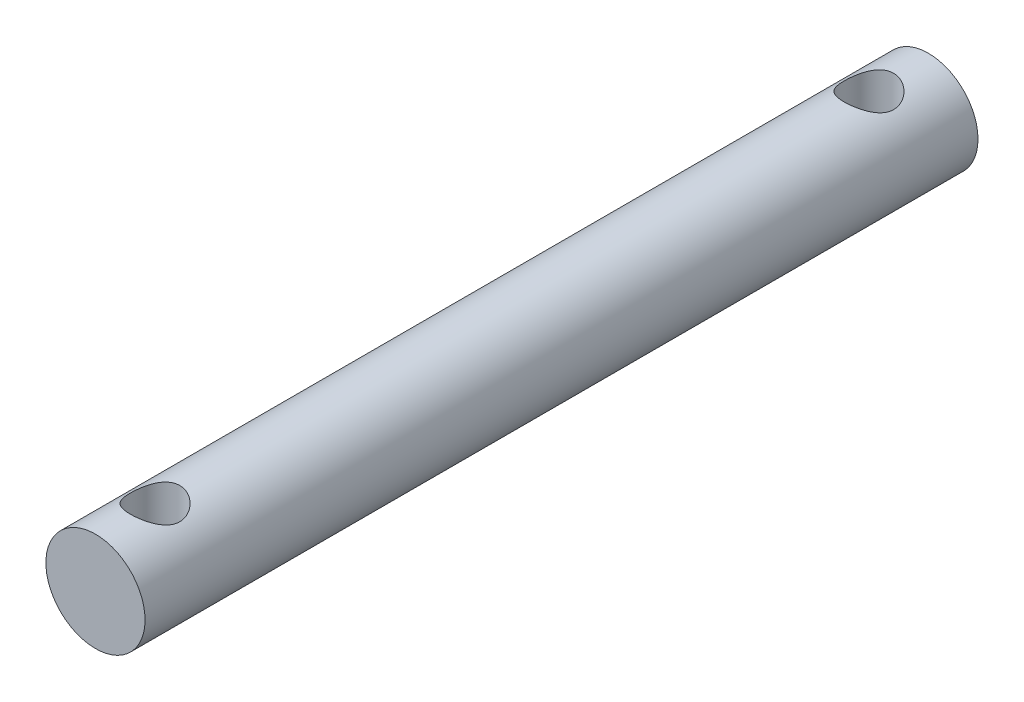
ISO-10303-21;
HEADER;
FILE_DESCRIPTION(('STEP AP214'),'2;1');
FILE_NAME('part.step','',(''),(''),'','','');
FILE_SCHEMA(('AUTOMOTIVE_DESIGN { 1 0 10303 214 1 1 1 1 }'));
ENDSEC;
DATA;
#1=APPLICATION_CONTEXT('core data for automotive mechanical design processes');
#2=APPLICATION_PROTOCOL_DEFINITION('international standard','automotive_design',2000,#1);
#3=PRODUCT_CONTEXT('',#1,'mechanical');
#4=PRODUCT('Part','Part','',(#3));
#5=PRODUCT_RELATED_PRODUCT_CATEGORY('part','',(#4));
#6=PRODUCT_DEFINITION_FORMATION('','',#4);
#7=PRODUCT_DEFINITION_CONTEXT('part definition',#1,'design');
#8=PRODUCT_DEFINITION('design','',#6,#7);
#9=PRODUCT_DEFINITION_SHAPE('','',#8);
#10=(LENGTH_UNIT() NAMED_UNIT(*) SI_UNIT(.MILLI.,.METRE.));
#11=(NAMED_UNIT(*) PLANE_ANGLE_UNIT() SI_UNIT($,.RADIAN.));
#12=(NAMED_UNIT(*) SI_UNIT($,.STERADIAN.) SOLID_ANGLE_UNIT());
#13=UNCERTAINTY_MEASURE_WITH_UNIT(LENGTH_MEASURE(1.E-05),#10,'distance_accuracy_value','');
#14=(GEOMETRIC_REPRESENTATION_CONTEXT(3) GLOBAL_UNCERTAINTY_ASSIGNED_CONTEXT((#13)) GLOBAL_UNIT_ASSIGNED_CONTEXT((#10,
#11,#12)) REPRESENTATION_CONTEXT('',''));
#15=CARTESIAN_POINT('',(0.,0.,0.));
#16=DIRECTION('',(0.,0.,1.));
#17=DIRECTION('',(1.,0.,0.));
#18=AXIS2_PLACEMENT_3D('',#15,#16,#17);
#19=CARTESIAN_POINT('',(0.,0.,42.));
#20=DIRECTION('',(0.,0.,-1.));
#21=DIRECTION('',(-1.,0.,0.));
#22=AXIS2_PLACEMENT_3D('',#19,#20,#21);
#23=CYLINDRICAL_SURFACE('',#22,2.5);
#24=CARTESIAN_POINT('',(0.,-2.5,4.25));
#25=CARTESIAN_POINT('',(0.065714953691233,-2.49999641755189,4.24999587210062));
#26=CARTESIAN_POINT('',(0.13150824962254,-2.49738113774397,4.24478740859791));
#27=CARTESIAN_POINT('',(0.261150294085531,-2.48717695046745,4.22418389957385));
#28=CARTESIAN_POINT('',(0.324995108391879,-2.47957859786229,4.20876950875294));
#29=CARTESIAN_POINT('',(0.448666931100717,-2.46020349254139,4.16850773922901));
#30=CARTESIAN_POINT('',(0.508508503673974,-2.448442989719,4.14369701968999));
#31=CARTESIAN_POINT('',(0.623090771008205,-2.42182220644723,4.08553672329383));
#32=CARTESIAN_POINT('',(0.677831867487561,-2.40696217041913,4.05218781968894));
#33=CARTESIAN_POINT('',(0.784384772202398,-2.37445322822571,3.97560343814338));
#34=CARTESIAN_POINT('',(0.835819013902639,-2.3566899890942,3.93189190095045));
#35=CARTESIAN_POINT('',(0.930974306083721,-2.3207496280843,3.83684815094121));
#36=CARTESIAN_POINT('',(0.974689478883458,-2.30257220261294,3.78551018528445));
#37=CARTESIAN_POINT('',(1.05656500056285,-2.26623688996684,3.67189581309577));
#38=CARTESIAN_POINT('',(1.09403166943955,-2.24818983712665,3.60907987706761));
#39=CARTESIAN_POINT('',(1.15771028361337,-2.21607473465401,3.47704083001723));
#40=CARTESIAN_POINT('',(1.18393026870792,-2.20200384508737,3.40782233909656));
#41=CARTESIAN_POINT('',(1.22266555273574,-2.18072333797261,3.2691686182226));
#42=CARTESIAN_POINT('',(1.23590732135055,-2.17315339479642,3.19999443491576));
#43=CARTESIAN_POINT('',(1.25053374163606,-2.1647736243566,3.06002645277565));
#44=CARTESIAN_POINT('',(1.25193011046634,-2.1639571167911,2.98923432391106));
#45=CARTESIAN_POINT('',(1.24335910896537,-2.16888662821561,2.85714246960579));
#46=CARTESIAN_POINT('',(1.23473069942103,-2.17385954577517,2.79571996097119));
#47=CARTESIAN_POINT('',(1.20867481132117,-2.18845285917313,2.6753476132837));
#48=CARTESIAN_POINT('',(1.19124452987206,-2.1980747353972,2.61639856836835));
#49=CARTESIAN_POINT('',(1.1477622254825,-2.22109345515926,2.50096358429292));
#50=CARTESIAN_POINT('',(1.12151883389499,-2.23457300829998,2.44456700151776));
#51=CARTESIAN_POINT('',(1.061302109585,-2.26379255351755,2.33670713426249));
#52=CARTESIAN_POINT('',(1.02732530476558,-2.27953355975238,2.28524608049989));
#53=CARTESIAN_POINT('',(0.947582568640986,-2.31391447379107,2.18184843407097));
#54=CARTESIAN_POINT('',(0.900868072961602,-2.33266887795933,2.1306789080298));
#55=CARTESIAN_POINT('',(0.799444473426717,-2.36934529125509,2.03658072676137));
#56=CARTESIAN_POINT('',(0.744731570717857,-2.38726689948501,1.99365600995765));
#57=CARTESIAN_POINT('',(0.625645632289811,-2.42127484103705,1.91539292371284));
#58=CARTESIAN_POINT('',(0.560941989499262,-2.43723730202509,1.88049940944283));
#59=CARTESIAN_POINT('',(0.425582769360997,-2.46447351401553,1.82237871369624));
#60=CARTESIAN_POINT('',(0.354931970331597,-2.47575098679441,1.79914226873104));
#61=CARTESIAN_POINT('',(0.215958114575879,-2.49155417176795,1.76690574535416));
#62=CARTESIAN_POINT('',(0.147926913185407,-2.4965617287664,1.75688595531653));
#63=CARTESIAN_POINT('',(0.0109744999366933,-2.50091266823877,1.74816908608189));
#64=CARTESIAN_POINT('',(-0.0579462748373757,-2.5002587340164,1.74946664295065));
#65=CARTESIAN_POINT('',(-0.189041214982491,-2.49363990316801,1.76275836052344));
#66=CARTESIAN_POINT('',(-0.251324260062442,-2.48809057110237,1.77391566591254));
#67=CARTESIAN_POINT('',(-0.373008615377396,-2.47277714143524,1.80529758986886));
#68=CARTESIAN_POINT('',(-0.432409607113746,-2.46301257917916,1.8255232080667));
#69=CARTESIAN_POINT('',(-0.548610760562082,-2.43980314267087,1.87499808304146));
#70=CARTESIAN_POINT('',(-0.605287996257692,-2.42626102212424,1.90448881264602));
#71=CARTESIAN_POINT('',(-0.713076702123652,-2.39679967896386,1.97138441955755));
#72=CARTESIAN_POINT('',(-0.764185787219103,-2.38087944457231,2.00879266824179));
#73=CARTESIAN_POINT('',(-0.864709611613317,-2.3463527667183,2.09470053166609));
#74=CARTESIAN_POINT('',(-0.913465097280799,-2.32763606060552,2.14392858556696));
#75=CARTESIAN_POINT('',(-1.00232040139155,-2.29077989504843,2.24990643908663));
#76=CARTESIAN_POINT('',(-1.04241423211355,-2.27264084226908,2.30666139852047));
#77=CARTESIAN_POINT('',(-1.11463489312212,-2.23813990282585,2.42955456775039));
#78=CARTESIAN_POINT('',(-1.1462818698483,-2.2219066207934,2.49601408276074));
#79=CARTESIAN_POINT('',(-1.19760353251725,-2.19467590460158,2.63438758461565));
#80=CARTESIAN_POINT('',(-1.21729364485946,-2.18367172800773,2.70629440812648));
#81=CARTESIAN_POINT('',(-1.2423271093121,-2.16951876260833,2.84613777857681));
#82=CARTESIAN_POINT('',(-1.24886624550108,-2.16571729325614,2.91379281678629));
#83=CARTESIAN_POINT('',(-1.25086144297598,-2.16456693307719,3.04930883396341));
#84=CARTESIAN_POINT('',(-1.2463223082805,-2.16721524534441,3.11716971092429));
#85=CARTESIAN_POINT('',(-1.22740765699033,-2.17797327562531,3.24435437691502));
#86=CARTESIAN_POINT('',(-1.2140103929285,-2.18553868102992,3.3038755876805));
#87=CARTESIAN_POINT('',(-1.17896919778081,-2.20463770234897,3.41976014928088));
#88=CARTESIAN_POINT('',(-1.15732261394976,-2.21617259462094,3.47612247761496));
#89=CARTESIAN_POINT('',(-1.10476968162585,-2.2428566295566,3.58828106373326));
#90=CARTESIAN_POINT('',(-1.07333892227057,-2.25819652995238,3.64378487728712));
#91=CARTESIAN_POINT('',(-1.00268871454579,-2.29044164543238,3.74909317022573));
#92=CARTESIAN_POINT('',(-0.963465214048312,-2.30734767243153,3.79889466314811));
#93=CARTESIAN_POINT('',(-0.872754158330802,-2.34327903949141,3.89767747794702));
#94=CARTESIAN_POINT('',(-0.820355528762715,-2.36231229139336,3.9458238779524));
#95=CARTESIAN_POINT('',(-0.70769350777535,-2.3984719031886,4.03282872927954));
#96=CARTESIAN_POINT('',(-0.647425904070981,-2.4155972326005,4.07168217428286));
#97=CARTESIAN_POINT('',(-0.519914496024933,-2.44622511981379,4.13904545345276));
#98=CARTESIAN_POINT('',(-0.452624379918268,-2.45970120703636,4.16748021176429));
#99=CARTESIAN_POINT('',(-0.313427626617738,-2.48126676704332,4.21226020989869));
#100=CARTESIAN_POINT('',(-0.241534749528957,-2.48937154216165,4.22863980853697));
#101=CARTESIAN_POINT('',(-0.140752433104229,-2.49619327387079,4.24237176384481));
#102=CARTESIAN_POINT('',(-0.112702349299373,-2.49761706674002,4.24522830107952));
#103=CARTESIAN_POINT('',(-0.0564396647589471,-2.49952121222331,4.24904333189601));
#104=CARTESIAN_POINT('',(-0.0282270595592268,-2.50000153879704,4.250001773089));
#105=CARTESIAN_POINT('',(0.,-2.5,4.25));
#106=B_SPLINE_CURVE_WITH_KNOTS('',3,(#24,#25,#26,#27,#28,#29,#30,#31,#32,#33,#34,#35,#36,#37,
#38,#39,#40,#41,#42,#43,#44,#45,#46,#47,#48,#49,#50,#51,#52,#53,#54,#55,#56,#57,#58,#59,#60,#61,
#62,#63,#64,#65,#66,#67,#68,#69,#70,#71,#72,#73,#74,#75,#76,#77,#78,#79,#80,#81,#82,#83,#84,#85,
#86,#87,#88,#89,#90,#91,#92,#93,#94,#95,#96,#97,#98,#99,#100,#101,#102,#103,#104,#105),
.UNSPECIFIED.,.T.,.F.,(4,2,2,2,2,2,2,2,2,2,2,2,2,2,2,2,2,2,2,2,2,2,2,2,2,2,2,2,2,2,2,2,2,2,2,2,
2,2,2,2,4),(0.,0.197030321775365,0.394435187136497,0.591077694365372,0.787704700726959,
0.99622719839761,1.20490779706754,1.42977158038441,1.65447434872851,1.86572515175287,
2.07676696661276,2.26257140511651,2.44843504907098,2.63862800210609,2.82890651575277,
3.04331176667348,3.25781918248358,3.48228777768051,3.70657771140349,3.91229113089182,
4.11790705639345,4.30758633132652,4.49728652038664,4.69241070034873,4.88761813435424,
5.10199513305524,5.3165198576929,5.54143352699592,5.76605639925972,5.96911634372967,
6.17208824825007,6.35572412805228,6.53941910979597,6.73545570969518,6.93159451423697,
7.15156553440623,7.37165479220716,7.59330017078657,7.81431135781163,7.89894100172122,
7.98357298143559),.UNSPECIFIED.);
#107=CARTESIAN_POINT('',(0.,-2.5,4.25));
#108=VERTEX_POINT('',#107);
#109=EDGE_CURVE('E10',#108,#108,#106,.T.);
#110=ORIENTED_EDGE('',*,*,#109,.T.);
#111=EDGE_LOOP('',(#110));
#112=FACE_BOUND('',#111,.T.);
#113=CARTESIAN_POINT('',(0.,2.5,4.25));
#114=CARTESIAN_POINT('',(-0.065714953691233,2.49999641755189,4.24999587210062));
#115=CARTESIAN_POINT('',(-0.13150824962254,2.49738113774397,4.24478740859791));
#116=CARTESIAN_POINT('',(-0.261150294085531,2.48717695046745,4.22418389957385));
#117=CARTESIAN_POINT('',(-0.324995108391879,2.47957859786229,4.20876950875294));
#118=CARTESIAN_POINT('',(-0.448666931100717,2.46020349254139,4.16850773922901));
#119=CARTESIAN_POINT('',(-0.508508503673974,2.448442989719,4.14369701968999));
#120=CARTESIAN_POINT('',(-0.623090771008205,2.42182220644723,4.08553672329383));
#121=CARTESIAN_POINT('',(-0.677831867487561,2.40696217041913,4.05218781968894));
#122=CARTESIAN_POINT('',(-0.784384772202398,2.37445322822571,3.97560343814338));
#123=CARTESIAN_POINT('',(-0.835819013902639,2.3566899890942,3.93189190095045));
#124=CARTESIAN_POINT('',(-0.930974306083721,2.3207496280843,3.83684815094121));
#125=CARTESIAN_POINT('',(-0.974689478883458,2.30257220261294,3.78551018528445));
#126=CARTESIAN_POINT('',(-1.05656500056285,2.26623688996684,3.67189581309577));
#127=CARTESIAN_POINT('',(-1.09403166943955,2.24818983712665,3.60907987706761));
#128=CARTESIAN_POINT('',(-1.15771028361337,2.21607473465401,3.47704083001723));
#129=CARTESIAN_POINT('',(-1.18393026870792,2.20200384508737,3.40782233909656));
#130=CARTESIAN_POINT('',(-1.22266555273574,2.18072333797261,3.2691686182226));
#131=CARTESIAN_POINT('',(-1.23590732135055,2.17315339479642,3.19999443491576));
#132=CARTESIAN_POINT('',(-1.25053374163606,2.1647736243566,3.06002645277565));
#133=CARTESIAN_POINT('',(-1.25193011046634,2.1639571167911,2.98923432391106));
#134=CARTESIAN_POINT('',(-1.24335910896537,2.16888662821561,2.85714246960579));
#135=CARTESIAN_POINT('',(-1.23473069942103,2.17385954577517,2.79571996097119));
#136=CARTESIAN_POINT('',(-1.20867481132117,2.18845285917313,2.6753476132837));
#137=CARTESIAN_POINT('',(-1.19124452987206,2.1980747353972,2.61639856836835));
#138=CARTESIAN_POINT('',(-1.1477622254825,2.22109345515926,2.50096358429292));
#139=CARTESIAN_POINT('',(-1.12151883389499,2.23457300829998,2.44456700151776));
#140=CARTESIAN_POINT('',(-1.061302109585,2.26379255351755,2.33670713426249));
#141=CARTESIAN_POINT('',(-1.02732530476558,2.27953355975238,2.28524608049989));
#142=CARTESIAN_POINT('',(-0.947582568640986,2.31391447379107,2.18184843407097));
#143=CARTESIAN_POINT('',(-0.900868072961602,2.33266887795933,2.1306789080298));
#144=CARTESIAN_POINT('',(-0.799444473426717,2.36934529125509,2.03658072676137));
#145=CARTESIAN_POINT('',(-0.744731570717857,2.38726689948501,1.99365600995765));
#146=CARTESIAN_POINT('',(-0.625645632289811,2.42127484103705,1.91539292371284));
#147=CARTESIAN_POINT('',(-0.560941989499262,2.43723730202509,1.88049940944283));
#148=CARTESIAN_POINT('',(-0.425582769360997,2.46447351401553,1.82237871369624));
#149=CARTESIAN_POINT('',(-0.354931970331597,2.47575098679441,1.79914226873104));
#150=CARTESIAN_POINT('',(-0.215958114575879,2.49155417176795,1.76690574535416));
#151=CARTESIAN_POINT('',(-0.147926913185407,2.4965617287664,1.75688595531653));
#152=CARTESIAN_POINT('',(-0.0109744999366933,2.50091266823877,1.74816908608189));
#153=CARTESIAN_POINT('',(0.0579462748373757,2.5002587340164,1.74946664295065));
#154=CARTESIAN_POINT('',(0.189041214982491,2.49363990316801,1.76275836052344));
#155=CARTESIAN_POINT('',(0.251324260062442,2.48809057110237,1.77391566591254));
#156=CARTESIAN_POINT('',(0.373008615377396,2.47277714143524,1.80529758986886));
#157=CARTESIAN_POINT('',(0.432409607113746,2.46301257917916,1.8255232080667));
#158=CARTESIAN_POINT('',(0.548610760562082,2.43980314267087,1.87499808304146));
#159=CARTESIAN_POINT('',(0.605287996257692,2.42626102212424,1.90448881264602));
#160=CARTESIAN_POINT('',(0.713076702123652,2.39679967896386,1.97138441955755));
#161=CARTESIAN_POINT('',(0.764185787219103,2.38087944457231,2.00879266824179));
#162=CARTESIAN_POINT('',(0.864709611613317,2.3463527667183,2.09470053166609));
#163=CARTESIAN_POINT('',(0.913465097280799,2.32763606060552,2.14392858556696));
#164=CARTESIAN_POINT('',(1.00232040139155,2.29077989504843,2.24990643908663));
#165=CARTESIAN_POINT('',(1.04241423211355,2.27264084226908,2.30666139852047));
#166=CARTESIAN_POINT('',(1.11463489312212,2.23813990282585,2.42955456775039));
#167=CARTESIAN_POINT('',(1.1462818698483,2.2219066207934,2.49601408276074));
#168=CARTESIAN_POINT('',(1.19760353251725,2.19467590460158,2.63438758461565));
#169=CARTESIAN_POINT('',(1.21729364485946,2.18367172800773,2.70629440812648));
#170=CARTESIAN_POINT('',(1.2423271093121,2.16951876260833,2.84613777857681));
#171=CARTESIAN_POINT('',(1.24886624550108,2.16571729325614,2.91379281678629));
#172=CARTESIAN_POINT('',(1.25086144297598,2.16456693307719,3.04930883396341));
#173=CARTESIAN_POINT('',(1.2463223082805,2.16721524534441,3.11716971092429));
#174=CARTESIAN_POINT('',(1.22740765699033,2.17797327562531,3.24435437691502));
#175=CARTESIAN_POINT('',(1.2140103929285,2.18553868102992,3.3038755876805));
#176=CARTESIAN_POINT('',(1.17896919778081,2.20463770234897,3.41976014928088));
#177=CARTESIAN_POINT('',(1.15732261394976,2.21617259462094,3.47612247761496));
#178=CARTESIAN_POINT('',(1.10476968162585,2.2428566295566,3.58828106373326));
#179=CARTESIAN_POINT('',(1.07333892227057,2.25819652995238,3.64378487728712));
#180=CARTESIAN_POINT('',(1.00268871454579,2.29044164543238,3.74909317022573));
#181=CARTESIAN_POINT('',(0.963465214048312,2.30734767243153,3.79889466314811));
#182=CARTESIAN_POINT('',(0.872754158330802,2.34327903949141,3.89767747794702));
#183=CARTESIAN_POINT('',(0.820355528762715,2.36231229139336,3.9458238779524));
#184=CARTESIAN_POINT('',(0.70769350777535,2.3984719031886,4.03282872927954));
#185=CARTESIAN_POINT('',(0.647425904070981,2.4155972326005,4.07168217428286));
#186=CARTESIAN_POINT('',(0.519914496024933,2.44622511981379,4.13904545345276));
#187=CARTESIAN_POINT('',(0.452624379918268,2.45970120703636,4.16748021176429));
#188=CARTESIAN_POINT('',(0.313427626617738,2.48126676704332,4.21226020989869));
#189=CARTESIAN_POINT('',(0.241534749528957,2.48937154216165,4.22863980853697));
#190=CARTESIAN_POINT('',(0.140752433104229,2.49619327387079,4.24237176384481));
#191=CARTESIAN_POINT('',(0.112702349299373,2.49761706674002,4.24522830107952));
#192=CARTESIAN_POINT('',(0.0564396647589471,2.49952121222331,4.24904333189601));
#193=CARTESIAN_POINT('',(0.0282270595592268,2.50000153879704,4.250001773089));
#194=CARTESIAN_POINT('',(0.,2.5,4.25));
#195=B_SPLINE_CURVE_WITH_KNOTS('',3,(#113,#114,#115,#116,#117,#118,#119,#120,#121,#122,#123,
#124,#125,#126,#127,#128,#129,#130,#131,#132,#133,#134,#135,#136,#137,#138,#139,#140,#141,#142,
#143,#144,#145,#146,#147,#148,#149,#150,#151,#152,#153,#154,#155,#156,#157,#158,#159,#160,#161,
#162,#163,#164,#165,#166,#167,#168,#169,#170,#171,#172,#173,#174,#175,#176,#177,#178,#179,#180,
#181,#182,#183,#184,#185,#186,#187,#188,#189,#190,#191,#192,#193,#194),.UNSPECIFIED.,.T.,.F.,(4,
2,2,2,2,2,2,2,2,2,2,2,2,2,2,2,2,2,2,2,2,2,2,2,2,2,2,2,2,2,2,2,2,2,2,2,2,2,2,2,4),(0.,
0.197030321775365,0.394435187136497,0.591077694365372,0.787704700726959,0.99622719839761,
1.20490779706754,1.42977158038441,1.65447434872851,1.86572515175287,2.07676696661276,
2.26257140511651,2.44843504907098,2.63862800210609,2.82890651575277,3.04331176667348,
3.25781918248358,3.48228777768051,3.70657771140349,3.91229113089182,4.11790705639345,
4.30758633132652,4.49728652038664,4.69241070034873,4.88761813435424,5.10199513305524,
5.3165198576929,5.54143352699592,5.76605639925972,5.96911634372967,6.17208824825007,
6.35572412805228,6.53941910979597,6.73545570969518,6.93159451423697,7.15156553440623,
7.37165479220716,7.59330017078657,7.81431135781163,7.89894100172122,7.98357298143559),.UNSPECIFIED.);
#196=CARTESIAN_POINT('',(0.,2.5,4.25));
#197=VERTEX_POINT('',#196);
#198=EDGE_CURVE('E55',#197,#197,#195,.T.);
#199=ORIENTED_EDGE('',*,*,#198,.T.);
#200=EDGE_LOOP('',(#199));
#201=FACE_BOUND('',#200,.T.);
#202=CARTESIAN_POINT('',(0.,-2.5,40.25));
#203=CARTESIAN_POINT('',(0.0657149536912329,-2.49999641755189,40.2499958721006));
#204=CARTESIAN_POINT('',(0.13150824962254,-2.49738113774397,40.2447874085979));
#205=CARTESIAN_POINT('',(0.261150294085531,-2.48717695046745,40.2241838995739));
#206=CARTESIAN_POINT('',(0.324995108391879,-2.47957859786229,40.2087695087529));
#207=CARTESIAN_POINT('',(0.448666931100718,-2.46020349254139,40.168507739229));
#208=CARTESIAN_POINT('',(0.508508503673975,-2.448442989719,40.14369701969));
#209=CARTESIAN_POINT('',(0.623090771008205,-2.42182220644723,40.0855367232938));
#210=CARTESIAN_POINT('',(0.67783186748756,-2.40696217041913,40.0521878196889));
#211=CARTESIAN_POINT('',(0.784384772202397,-2.37445322822571,39.9756034381434));
#212=CARTESIAN_POINT('',(0.83581901390264,-2.3566899890942,39.9318919009504));
#213=CARTESIAN_POINT('',(0.930974306083722,-2.3207496280843,39.8368481509412));
#214=CARTESIAN_POINT('',(0.974689478883457,-2.30257220261294,39.7855101852845));
#215=CARTESIAN_POINT('',(1.05656500056285,-2.26623688996684,39.6718958130958));
#216=CARTESIAN_POINT('',(1.09403166943955,-2.24818983712665,39.6090798770676));
#217=CARTESIAN_POINT('',(1.15771028361337,-2.21607473465401,39.4770408300172));
#218=CARTESIAN_POINT('',(1.18393026870792,-2.20200384508737,39.4078223390966));
#219=CARTESIAN_POINT('',(1.22266555273574,-2.18072333797261,39.2691686182226));
#220=CARTESIAN_POINT('',(1.23590732135055,-2.17315339479642,39.1999944349158));
#221=CARTESIAN_POINT('',(1.25053374163606,-2.1647736243566,39.0600264527757));
#222=CARTESIAN_POINT('',(1.25193011046634,-2.1639571167911,38.9892343239111));
#223=CARTESIAN_POINT('',(1.24335910896537,-2.1688866282156,38.8571424696058));
#224=CARTESIAN_POINT('',(1.23473069942103,-2.17385954577517,38.7957199609712));
#225=CARTESIAN_POINT('',(1.20867481132117,-2.18845285917313,38.6753476132837));
#226=CARTESIAN_POINT('',(1.19124452987207,-2.1980747353972,38.6163985683684));
#227=CARTESIAN_POINT('',(1.14776222548251,-2.22109345515926,38.5009635842929));
#228=CARTESIAN_POINT('',(1.121518833895,-2.23457300829998,38.4445670015178));
#229=CARTESIAN_POINT('',(1.06130210958501,-2.26379255351754,38.3367071342625));
#230=CARTESIAN_POINT('',(1.02732530476559,-2.27953355975238,38.2852460804999));
#231=CARTESIAN_POINT('',(0.947582568640989,-2.31391447379107,38.181848434071));
#232=CARTESIAN_POINT('',(0.900868072961607,-2.33266887795932,38.1306789080298));
#233=CARTESIAN_POINT('',(0.799444473426722,-2.36934529125509,38.0365807267614));
#234=CARTESIAN_POINT('',(0.744731570717861,-2.38726689948501,37.9936560099576));
#235=CARTESIAN_POINT('',(0.625645632289813,-2.42127484103705,37.9153929237128));
#236=CARTESIAN_POINT('',(0.560941989499263,-2.43723730202509,37.8804994094428));
#237=CARTESIAN_POINT('',(0.425582769360997,-2.46447351401553,37.8223787136962));
#238=CARTESIAN_POINT('',(0.354931970331596,-2.47575098679441,37.799142268731));
#239=CARTESIAN_POINT('',(0.215958114575878,-2.49155417176795,37.7669057453542));
#240=CARTESIAN_POINT('',(0.147926913185406,-2.4965617287664,37.7568859553165));
#241=CARTESIAN_POINT('',(0.0109744999366936,-2.50091266823877,37.7481690860819));
#242=CARTESIAN_POINT('',(-0.0579462748373749,-2.5002587340164,37.7494666429507));
#243=CARTESIAN_POINT('',(-0.18904121498249,-2.49363990316801,37.7627583605234));
#244=CARTESIAN_POINT('',(-0.251324260062442,-2.48809057110237,37.7739156659125));
#245=CARTESIAN_POINT('',(-0.373008615377395,-2.47277714143524,37.8052975898689));
#246=CARTESIAN_POINT('',(-0.432409607113745,-2.46301257917916,37.8255232080667));
#247=CARTESIAN_POINT('',(-0.548610760562082,-2.43980314267087,37.8749980830415));
#248=CARTESIAN_POINT('',(-0.605287996257694,-2.42626102212424,37.904488812646));
#249=CARTESIAN_POINT('',(-0.713076702123653,-2.39679967896386,37.9713844195576));
#250=CARTESIAN_POINT('',(-0.764185787219104,-2.38087944457231,38.0087926682418));
#251=CARTESIAN_POINT('',(-0.864709611613318,-2.3463527667183,38.0947005316661));
#252=CARTESIAN_POINT('',(-0.913465097280802,-2.32763606060552,38.143928585567));
#253=CARTESIAN_POINT('',(-1.00232040139155,-2.29077989504843,38.2499064390866));
#254=CARTESIAN_POINT('',(-1.04241423211355,-2.27264084226908,38.3066613985205));
#255=CARTESIAN_POINT('',(-1.11463489312212,-2.23813990282585,38.4295545677504));
#256=CARTESIAN_POINT('',(-1.1462818698483,-2.2219066207934,38.4960140827607));
#257=CARTESIAN_POINT('',(-1.19760353251725,-2.19467590460158,38.6343875846157));
#258=CARTESIAN_POINT('',(-1.21729364485946,-2.18367172800772,38.7062944081265));
#259=CARTESIAN_POINT('',(-1.2423271093121,-2.16951876260833,38.8461377785768));
#260=CARTESIAN_POINT('',(-1.24886624550108,-2.16571729325614,38.9137928167863));
#261=CARTESIAN_POINT('',(-1.25086144297598,-2.16456693307719,39.0493088339634));
#262=CARTESIAN_POINT('',(-1.2463223082805,-2.16721524534441,39.1171697109243));
#263=CARTESIAN_POINT('',(-1.22740765699033,-2.17797327562531,39.244354376915));
#264=CARTESIAN_POINT('',(-1.2140103929285,-2.18553868102992,39.3038755876805));
#265=CARTESIAN_POINT('',(-1.17896919778081,-2.20463770234897,39.4197601492809));
#266=CARTESIAN_POINT('',(-1.15732261394976,-2.21617259462094,39.476122477615));
#267=CARTESIAN_POINT('',(-1.10476968162585,-2.2428566295566,39.5882810637333));
#268=CARTESIAN_POINT('',(-1.07333892227057,-2.25819652995238,39.6437848772871));
#269=CARTESIAN_POINT('',(-1.00268871454579,-2.29044164543238,39.7490931702257));
#270=CARTESIAN_POINT('',(-0.963465214048309,-2.30734767243153,39.7988946631481));
#271=CARTESIAN_POINT('',(-0.872754158330802,-2.34327903949141,39.897677477947));
#272=CARTESIAN_POINT('',(-0.820355528762715,-2.36231229139336,39.9458238779524));
#273=CARTESIAN_POINT('',(-0.70769350777535,-2.3984719031886,40.0328287292795));
#274=CARTESIAN_POINT('',(-0.647425904070982,-2.4155972326005,40.0716821742829));
#275=CARTESIAN_POINT('',(-0.519914496024933,-2.44622511981379,40.1390454534528));
#276=CARTESIAN_POINT('',(-0.452624379918267,-2.45970120703636,40.1674802117643));
#277=CARTESIAN_POINT('',(-0.313427626617739,-2.48126676704332,40.2122602098987));
#278=CARTESIAN_POINT('',(-0.241534749528958,-2.48937154216165,40.228639808537));
#279=CARTESIAN_POINT('',(-0.140752433104231,-2.49619327387079,40.2423717638448));
#280=CARTESIAN_POINT('',(-0.112702349299374,-2.49761706674002,40.2452283010795));
#281=CARTESIAN_POINT('',(-0.0564396647589478,-2.49952121222331,40.249043331896));
#282=CARTESIAN_POINT('',(-0.0282270595592271,-2.50000153879704,40.250001773089));
#283=CARTESIAN_POINT('',(0.,-2.5,40.25));
#284=B_SPLINE_CURVE_WITH_KNOTS('',3,(#202,#203,#204,#205,#206,#207,#208,#209,#210,#211,#212,
#213,#214,#215,#216,#217,#218,#219,#220,#221,#222,#223,#224,#225,#226,#227,#228,#229,#230,#231,
#232,#233,#234,#235,#236,#237,#238,#239,#240,#241,#242,#243,#244,#245,#246,#247,#248,#249,#250,
#251,#252,#253,#254,#255,#256,#257,#258,#259,#260,#261,#262,#263,#264,#265,#266,#267,#268,#269,
#270,#271,#272,#273,#274,#275,#276,#277,#278,#279,#280,#281,#282,#283),.UNSPECIFIED.,.T.,.F.,(4,
2,2,2,2,2,2,2,2,2,2,2,2,2,2,2,2,2,2,2,2,2,2,2,2,2,2,2,2,2,2,2,2,2,2,2,2,2,2,2,4),(0.,
0.197030321775365,0.394435187136496,0.591077694365373,0.787704700726959,0.996227198397609,
1.20490779706754,1.4297715803844,1.65447434872851,1.86572515175287,2.07676696661276,
2.2625714051165,2.44843504907097,2.63862800210609,2.82890651575277,3.04331176667348,
3.25781918248358,3.48228777768051,3.7065777114035,3.91229113089182,4.11790705639345,
4.30758633132653,4.49728652038665,4.69241070034874,4.88761813435425,5.10199513305525,
5.3165198576929,5.54143352699593,5.76605639925973,5.96911634372967,6.17208824825007,
6.35572412805229,6.53941910979599,6.73545570969519,6.93159451423698,7.15156553440624,
7.37165479220717,7.59330017078657,7.81431135781163,7.89894100172123,7.98357298143559),.UNSPECIFIED.);
#285=CARTESIAN_POINT('',(0.,-2.5,40.25));
#286=VERTEX_POINT('',#285);
#287=EDGE_CURVE('E60',#286,#286,#284,.T.);
#288=ORIENTED_EDGE('',*,*,#287,.T.);
#289=EDGE_LOOP('',(#288));
#290=FACE_BOUND('',#289,.T.);
#291=CARTESIAN_POINT('',(0.,2.5,40.25));
#292=CARTESIAN_POINT('',(-0.0657149536912329,2.49999641755189,40.2499958721006));
#293=CARTESIAN_POINT('',(-0.13150824962254,2.49738113774397,40.2447874085979));
#294=CARTESIAN_POINT('',(-0.261150294085531,2.48717695046745,40.2241838995739));
#295=CARTESIAN_POINT('',(-0.324995108391879,2.47957859786229,40.2087695087529));
#296=CARTESIAN_POINT('',(-0.448666931100718,2.46020349254139,40.168507739229));
#297=CARTESIAN_POINT('',(-0.508508503673975,2.448442989719,40.14369701969));
#298=CARTESIAN_POINT('',(-0.623090771008205,2.42182220644723,40.0855367232938));
#299=CARTESIAN_POINT('',(-0.67783186748756,2.40696217041913,40.0521878196889));
#300=CARTESIAN_POINT('',(-0.784384772202397,2.37445322822571,39.9756034381434));
#301=CARTESIAN_POINT('',(-0.83581901390264,2.3566899890942,39.9318919009504));
#302=CARTESIAN_POINT('',(-0.930974306083722,2.3207496280843,39.8368481509412));
#303=CARTESIAN_POINT('',(-0.974689478883457,2.30257220261294,39.7855101852845));
#304=CARTESIAN_POINT('',(-1.05656500056285,2.26623688996684,39.6718958130958));
#305=CARTESIAN_POINT('',(-1.09403166943955,2.24818983712665,39.6090798770676));
#306=CARTESIAN_POINT('',(-1.15771028361337,2.21607473465401,39.4770408300172));
#307=CARTESIAN_POINT('',(-1.18393026870792,2.20200384508737,39.4078223390966));
#308=CARTESIAN_POINT('',(-1.22266555273574,2.18072333797261,39.2691686182226));
#309=CARTESIAN_POINT('',(-1.23590732135055,2.17315339479642,39.1999944349158));
#310=CARTESIAN_POINT('',(-1.25053374163606,2.1647736243566,39.0600264527757));
#311=CARTESIAN_POINT('',(-1.25193011046634,2.1639571167911,38.9892343239111));
#312=CARTESIAN_POINT('',(-1.24335910896537,2.1688866282156,38.8571424696058));
#313=CARTESIAN_POINT('',(-1.23473069942103,2.17385954577517,38.7957199609712));
#314=CARTESIAN_POINT('',(-1.20867481132117,2.18845285917313,38.6753476132837));
#315=CARTESIAN_POINT('',(-1.19124452987207,2.1980747353972,38.6163985683684));
#316=CARTESIAN_POINT('',(-1.14776222548251,2.22109345515926,38.5009635842929));
#317=CARTESIAN_POINT('',(-1.121518833895,2.23457300829998,38.4445670015178));
#318=CARTESIAN_POINT('',(-1.06130210958501,2.26379255351754,38.3367071342625));
#319=CARTESIAN_POINT('',(-1.02732530476559,2.27953355975238,38.2852460804999));
#320=CARTESIAN_POINT('',(-0.947582568640989,2.31391447379107,38.181848434071));
#321=CARTESIAN_POINT('',(-0.900868072961607,2.33266887795932,38.1306789080298));
#322=CARTESIAN_POINT('',(-0.799444473426722,2.36934529125509,38.0365807267614));
#323=CARTESIAN_POINT('',(-0.744731570717861,2.38726689948501,37.9936560099576));
#324=CARTESIAN_POINT('',(-0.625645632289813,2.42127484103705,37.9153929237128));
#325=CARTESIAN_POINT('',(-0.560941989499263,2.43723730202509,37.8804994094428));
#326=CARTESIAN_POINT('',(-0.425582769360997,2.46447351401553,37.8223787136962));
#327=CARTESIAN_POINT('',(-0.354931970331596,2.47575098679441,37.799142268731));
#328=CARTESIAN_POINT('',(-0.215958114575878,2.49155417176795,37.7669057453542));
#329=CARTESIAN_POINT('',(-0.147926913185406,2.4965617287664,37.7568859553165));
#330=CARTESIAN_POINT('',(-0.0109744999366936,2.50091266823877,37.7481690860819));
#331=CARTESIAN_POINT('',(0.0579462748373749,2.5002587340164,37.7494666429507));
#332=CARTESIAN_POINT('',(0.18904121498249,2.49363990316801,37.7627583605234));
#333=CARTESIAN_POINT('',(0.251324260062442,2.48809057110237,37.7739156659125));
#334=CARTESIAN_POINT('',(0.373008615377395,2.47277714143524,37.8052975898689));
#335=CARTESIAN_POINT('',(0.432409607113745,2.46301257917916,37.8255232080667));
#336=CARTESIAN_POINT('',(0.548610760562082,2.43980314267087,37.8749980830415));
#337=CARTESIAN_POINT('',(0.605287996257694,2.42626102212424,37.904488812646));
#338=CARTESIAN_POINT('',(0.713076702123653,2.39679967896386,37.9713844195576));
#339=CARTESIAN_POINT('',(0.764185787219104,2.38087944457231,38.0087926682418));
#340=CARTESIAN_POINT('',(0.864709611613318,2.3463527667183,38.0947005316661));
#341=CARTESIAN_POINT('',(0.913465097280802,2.32763606060552,38.143928585567));
#342=CARTESIAN_POINT('',(1.00232040139155,2.29077989504843,38.2499064390866));
#343=CARTESIAN_POINT('',(1.04241423211355,2.27264084226908,38.3066613985205));
#344=CARTESIAN_POINT('',(1.11463489312212,2.23813990282585,38.4295545677504));
#345=CARTESIAN_POINT('',(1.1462818698483,2.2219066207934,38.4960140827607));
#346=CARTESIAN_POINT('',(1.19760353251725,2.19467590460158,38.6343875846157));
#347=CARTESIAN_POINT('',(1.21729364485946,2.18367172800772,38.7062944081265));
#348=CARTESIAN_POINT('',(1.2423271093121,2.16951876260833,38.8461377785768));
#349=CARTESIAN_POINT('',(1.24886624550108,2.16571729325614,38.9137928167863));
#350=CARTESIAN_POINT('',(1.25086144297598,2.16456693307719,39.0493088339634));
#351=CARTESIAN_POINT('',(1.2463223082805,2.16721524534441,39.1171697109243));
#352=CARTESIAN_POINT('',(1.22740765699033,2.17797327562531,39.244354376915));
#353=CARTESIAN_POINT('',(1.2140103929285,2.18553868102992,39.3038755876805));
#354=CARTESIAN_POINT('',(1.17896919778081,2.20463770234897,39.4197601492809));
#355=CARTESIAN_POINT('',(1.15732261394976,2.21617259462094,39.476122477615));
#356=CARTESIAN_POINT('',(1.10476968162585,2.2428566295566,39.5882810637333));
#357=CARTESIAN_POINT('',(1.07333892227057,2.25819652995238,39.6437848772871));
#358=CARTESIAN_POINT('',(1.00268871454579,2.29044164543238,39.7490931702257));
#359=CARTESIAN_POINT('',(0.963465214048309,2.30734767243153,39.7988946631481));
#360=CARTESIAN_POINT('',(0.872754158330802,2.34327903949141,39.897677477947));
#361=CARTESIAN_POINT('',(0.820355528762715,2.36231229139336,39.9458238779524));
#362=CARTESIAN_POINT('',(0.70769350777535,2.3984719031886,40.0328287292795));
#363=CARTESIAN_POINT('',(0.647425904070982,2.4155972326005,40.0716821742829));
#364=CARTESIAN_POINT('',(0.519914496024933,2.44622511981379,40.1390454534528));
#365=CARTESIAN_POINT('',(0.452624379918267,2.45970120703636,40.1674802117643));
#366=CARTESIAN_POINT('',(0.313427626617739,2.48126676704332,40.2122602098987));
#367=CARTESIAN_POINT('',(0.241534749528958,2.48937154216165,40.228639808537));
#368=CARTESIAN_POINT('',(0.140752433104231,2.49619327387079,40.2423717638448));
#369=CARTESIAN_POINT('',(0.112702349299374,2.49761706674002,40.2452283010795));
#370=CARTESIAN_POINT('',(0.0564396647589478,2.49952121222331,40.249043331896));
#371=CARTESIAN_POINT('',(0.0282270595592271,2.50000153879704,40.250001773089));
#372=CARTESIAN_POINT('',(0.,2.5,40.25));
#373=B_SPLINE_CURVE_WITH_KNOTS('',3,(#291,#292,#293,#294,#295,#296,#297,#298,#299,#300,#301,
#302,#303,#304,#305,#306,#307,#308,#309,#310,#311,#312,#313,#314,#315,#316,#317,#318,#319,#320,
#321,#322,#323,#324,#325,#326,#327,#328,#329,#330,#331,#332,#333,#334,#335,#336,#337,#338,#339,
#340,#341,#342,#343,#344,#345,#346,#347,#348,#349,#350,#351,#352,#353,#354,#355,#356,#357,#358,
#359,#360,#361,#362,#363,#364,#365,#366,#367,#368,#369,#370,#371,#372),.UNSPECIFIED.,.T.,.F.,(4,
2,2,2,2,2,2,2,2,2,2,2,2,2,2,2,2,2,2,2,2,2,2,2,2,2,2,2,2,2,2,2,2,2,2,2,2,2,2,2,4),(0.,
0.197030321775365,0.394435187136496,0.591077694365373,0.787704700726959,0.996227198397609,
1.20490779706754,1.4297715803844,1.65447434872851,1.86572515175287,2.07676696661276,
2.2625714051165,2.44843504907097,2.63862800210609,2.82890651575277,3.04331176667348,
3.25781918248358,3.48228777768051,3.7065777114035,3.91229113089182,4.11790705639345,
4.30758633132653,4.49728652038665,4.69241070034874,4.88761813435425,5.10199513305525,
5.3165198576929,5.54143352699593,5.76605639925973,5.96911634372967,6.17208824825007,
6.35572412805229,6.53941910979599,6.73545570969519,6.93159451423698,7.15156553440624,
7.37165479220717,7.59330017078657,7.81431135781163,7.89894100172123,7.98357298143559),.UNSPECIFIED.);
#374=CARTESIAN_POINT('',(0.,2.5,40.25));
#375=VERTEX_POINT('',#374);
#376=EDGE_CURVE('E65',#375,#375,#373,.T.);
#377=ORIENTED_EDGE('',*,*,#376,.T.);
#378=EDGE_LOOP('',(#377));
#379=FACE_BOUND('',#378,.T.);
#380=CARTESIAN_POINT('',(0.,0.,42.));
#381=DIRECTION('',(0.,0.,1.));
#382=DIRECTION('',(1.,0.,0.));
#383=AXIS2_PLACEMENT_3D('',#380,#381,#382);
#384=CIRCLE('',#383,2.5);
#385=CARTESIAN_POINT('',(2.5,0.,42.));
#386=VERTEX_POINT('',#385);
#387=EDGE_CURVE('E94',#386,#386,#384,.T.);
#388=ORIENTED_EDGE('',*,*,#387,.F.);
#389=EDGE_LOOP('',(#388));
#390=FACE_BOUND('',#389,.T.);
#391=CARTESIAN_POINT('',(0.,0.,0.));
#392=DIRECTION('',(0.,0.,1.));
#393=DIRECTION('',(1.,0.,0.));
#394=AXIS2_PLACEMENT_3D('',#391,#392,#393);
#395=CIRCLE('',#394,2.5);
#396=CARTESIAN_POINT('',(2.5,0.,0.));
#397=VERTEX_POINT('',#396);
#398=EDGE_CURVE('E95',#397,#397,#395,.T.);
#399=ORIENTED_EDGE('',*,*,#398,.T.);
#400=EDGE_LOOP('',(#399));
#401=FACE_BOUND('',#400,.T.);
#402=ADVANCED_FACE('F43',(#112,#201,#290,#379,#390,#401),#23,.T.);
#403=CARTESIAN_POINT('',(0.,0.,42.));
#404=DIRECTION('',(0.,0.,1.));
#405=DIRECTION('',(1.,0.,0.));
#406=AXIS2_PLACEMENT_3D('',#403,#404,#405);
#407=PLANE('',#406);
#408=ORIENTED_EDGE('',*,*,#387,.T.);
#409=EDGE_LOOP('',(#408));
#410=FACE_BOUND('',#409,.T.);
#411=ADVANCED_FACE('F86',(#410),#407,.T.);
#412=CARTESIAN_POINT('',(0.,0.,0.));
#413=DIRECTION('',(0.,0.,1.));
#414=DIRECTION('',(1.,0.,0.));
#415=AXIS2_PLACEMENT_3D('',#412,#413,#414);
#416=PLANE('',#415);
#417=ORIENTED_EDGE('',*,*,#398,.F.);
#418=EDGE_LOOP('',(#417));
#419=FACE_BOUND('',#418,.T.);
#420=ADVANCED_FACE('F84',(#419),#416,.F.);
#421=CARTESIAN_POINT('',(0.,-2.5,39.));
#422=DIRECTION('',(0.,1.,0.));
#423=DIRECTION('',(0.,0.,1.));
#424=AXIS2_PLACEMENT_3D('',#421,#422,#423);
#425=CYLINDRICAL_SURFACE('',#424,1.25);
#426=ORIENTED_EDGE('',*,*,#376,.F.);
#427=EDGE_LOOP('',(#426));
#428=FACE_BOUND('',#427,.T.);
#429=ORIENTED_EDGE('',*,*,#287,.F.);
#430=EDGE_LOOP('',(#429));
#431=FACE_BOUND('',#430,.T.);
#432=ADVANCED_FACE('F78',(#428,#431),#425,.F.);
#433=CARTESIAN_POINT('',(0.,-2.5,3.));
#434=DIRECTION('',(0.,1.,0.));
#435=DIRECTION('',(0.,0.,1.));
#436=AXIS2_PLACEMENT_3D('',#433,#434,#435);
#437=CYLINDRICAL_SURFACE('',#436,1.25);
#438=ORIENTED_EDGE('',*,*,#198,.F.);
#439=EDGE_LOOP('',(#438));
#440=FACE_BOUND('',#439,.T.);
#441=ORIENTED_EDGE('',*,*,#109,.F.);
#442=EDGE_LOOP('',(#441));
#443=FACE_BOUND('',#442,.T.);
#444=ADVANCED_FACE('F75',(#440,#443),#437,.F.);
#445=CLOSED_SHELL('',(#402,#411,#420,#432,#444));
#446=MANIFOLD_SOLID_BREP('B2',#445);
#447=ADVANCED_BREP_SHAPE_REPRESENTATION('',(#18,#446),#14);
#448=SHAPE_DEFINITION_REPRESENTATION(#9,#447);
ENDSEC;
END-ISO-10303-21;
